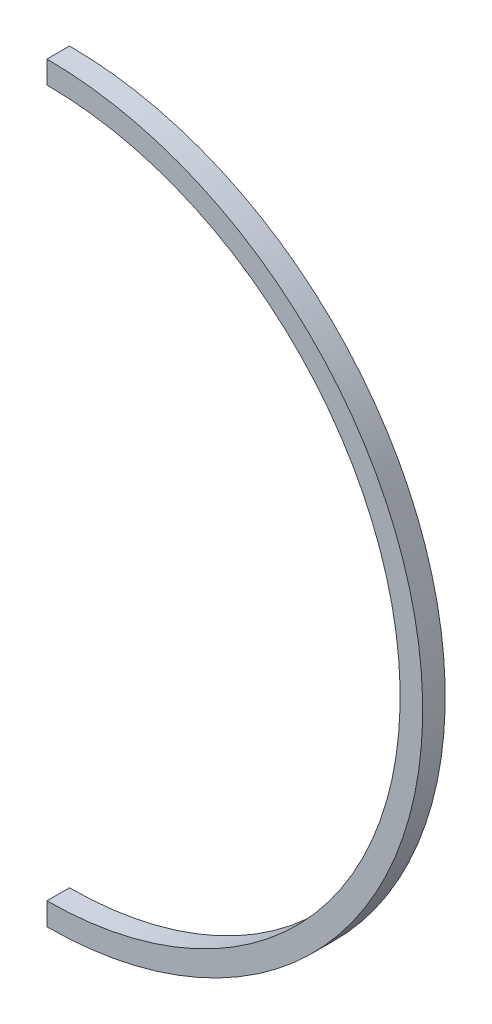
ISO-10303-21;
HEADER;
FILE_DESCRIPTION(('STEP AP214'),'2;1');
FILE_NAME('part.step','',(''),(''),'','','');
FILE_SCHEMA(('AUTOMOTIVE_DESIGN { 1 0 10303 214 1 1 1 1 }'));
ENDSEC;
DATA;
#1=APPLICATION_CONTEXT('core data for automotive mechanical design processes');
#2=APPLICATION_PROTOCOL_DEFINITION('international standard','automotive_design',2000,#1);
#3=PRODUCT_CONTEXT('',#1,'mechanical');
#4=PRODUCT('Part','Part','',(#3));
#5=PRODUCT_RELATED_PRODUCT_CATEGORY('part','',(#4));
#6=PRODUCT_DEFINITION_FORMATION('','',#4);
#7=PRODUCT_DEFINITION_CONTEXT('part definition',#1,'design');
#8=PRODUCT_DEFINITION('design','',#6,#7);
#9=PRODUCT_DEFINITION_SHAPE('','',#8);
#10=(LENGTH_UNIT() NAMED_UNIT(*) SI_UNIT(.MILLI.,.METRE.));
#11=(NAMED_UNIT(*) PLANE_ANGLE_UNIT() SI_UNIT($,.RADIAN.));
#12=(NAMED_UNIT(*) SI_UNIT($,.STERADIAN.) SOLID_ANGLE_UNIT());
#13=UNCERTAINTY_MEASURE_WITH_UNIT(LENGTH_MEASURE(1.E-05),#10,'distance_accuracy_value','');
#14=(GEOMETRIC_REPRESENTATION_CONTEXT(3) GLOBAL_UNCERTAINTY_ASSIGNED_CONTEXT((#13)) GLOBAL_UNIT_ASSIGNED_CONTEXT((#10,
#11,#12)) REPRESENTATION_CONTEXT('',''));
#15=CARTESIAN_POINT('',(0.,0.,0.));
#16=DIRECTION('',(0.,0.,1.));
#17=DIRECTION('',(1.,0.,0.));
#18=AXIS2_PLACEMENT_3D('',#15,#16,#17);
#19=CARTESIAN_POINT('',(0.,0.,3.));
#20=DIRECTION('',(0.,0.,1.));
#21=DIRECTION('',(1.,0.,0.));
#22=AXIS2_PLACEMENT_3D('',#19,#20,#21);
#23=PLANE('',#22);
#24=DIRECTION('',(0.,1.,0.));
#25=VECTOR('',#24,1.);
#26=CARTESIAN_POINT('',(300.,1.71683972880179E-13,3.));
#27=LINE('',#26,#25);
#28=CARTESIAN_POINT('',(300.,47.,3.));
#29=VERTEX_POINT('',#28);
#30=CARTESIAN_POINT('',(300.,50.,3.));
#31=VERTEX_POINT('',#30);
#32=EDGE_CURVE('E79',#29,#31,#27,.T.);
#33=ORIENTED_EDGE('',*,*,#32,.F.);
#34=CARTESIAN_POINT('',(300.,0.,3.));
#35=DIRECTION('',(0.,0.,1.));
#36=DIRECTION('',(1.,0.,0.));
#37=AXIS2_PLACEMENT_3D('',#34,#35,#36);
#38=CIRCLE('',#37,47.);
#39=CARTESIAN_POINT('',(300.,-47.,3.));
#40=VERTEX_POINT('',#39);
#41=EDGE_CURVE('E86',#29,#40,#38,.F.);
#42=ORIENTED_EDGE('',*,*,#41,.T.);
#43=DIRECTION('',(0.,1.,0.));
#44=VECTOR('',#43,1.);
#45=CARTESIAN_POINT('',(300.,1.71683972880179E-13,3.));
#46=LINE('',#45,#44);
#47=CARTESIAN_POINT('',(300.,-50.,3.));
#48=VERTEX_POINT('',#47);
#49=EDGE_CURVE('E85',#48,#40,#46,.T.);
#50=ORIENTED_EDGE('',*,*,#49,.F.);
#51=CARTESIAN_POINT('',(300.,0.,3.));
#52=DIRECTION('',(0.,0.,1.));
#53=DIRECTION('',(1.,0.,0.));
#54=AXIS2_PLACEMENT_3D('',#51,#52,#53);
#55=CIRCLE('',#54,50.);
#56=EDGE_CURVE('E74',#48,#31,#55,.T.);
#57=ORIENTED_EDGE('',*,*,#56,.T.);
#58=EDGE_LOOP('',(#33,#42,#50,#57));
#59=FACE_BOUND('',#58,.T.);
#60=ADVANCED_FACE('F32',(#59),#23,.T.);
#61=CARTESIAN_POINT('',(300.,0.,3.));
#62=DIRECTION('',(0.,0.,1.));
#63=DIRECTION('',(1.,0.,0.));
#64=AXIS2_PLACEMENT_3D('',#61,#62,#63);
#65=CYLINDRICAL_SURFACE('',#64,47.);
#66=ORIENTED_EDGE('',*,*,#41,.F.);
#67=DIRECTION('',(0.,0.,1.));
#68=VECTOR('',#67,1.);
#69=CARTESIAN_POINT('',(300.,47.,3.));
#70=LINE('',#69,#68);
#71=CARTESIAN_POINT('',(300.,47.,0.));
#72=VERTEX_POINT('',#71);
#73=EDGE_CURVE('E11',#72,#29,#70,.T.);
#74=ORIENTED_EDGE('',*,*,#73,.F.);
#75=CARTESIAN_POINT('',(300.,0.,0.));
#76=DIRECTION('',(0.,0.,-1.));
#77=DIRECTION('',(-1.,0.,0.));
#78=AXIS2_PLACEMENT_3D('',#75,#76,#77);
#79=CIRCLE('',#78,47.);
#80=CARTESIAN_POINT('',(300.,-47.,0.));
#81=VERTEX_POINT('',#80);
#82=EDGE_CURVE('E54',#72,#81,#79,.T.);
#83=ORIENTED_EDGE('',*,*,#82,.T.);
#84=DIRECTION('',(0.,0.,1.));
#85=VECTOR('',#84,1.);
#86=CARTESIAN_POINT('',(300.,-47.,3.));
#87=LINE('',#86,#85);
#88=EDGE_CURVE('E93',#81,#40,#87,.T.);
#89=ORIENTED_EDGE('',*,*,#88,.T.);
#90=EDGE_LOOP('',(#66,#74,#83,#89));
#91=FACE_BOUND('',#90,.T.);
#92=ADVANCED_FACE('F34',(#91),#65,.F.);
#93=CARTESIAN_POINT('',(300.,0.,60.));
#94=DIRECTION('',(0.,0.,-1.));
#95=DIRECTION('',(-1.,0.,0.));
#96=AXIS2_PLACEMENT_3D('',#93,#94,#95);
#97=CYLINDRICAL_SURFACE('',#96,50.);
#98=ORIENTED_EDGE('',*,*,#56,.F.);
#99=DIRECTION('',(0.,0.,-1.));
#100=VECTOR('',#99,1.);
#101=CARTESIAN_POINT('',(300.,-50.,60.));
#102=LINE('',#101,#100);
#103=CARTESIAN_POINT('',(300.,-50.,0.));
#104=VERTEX_POINT('',#103);
#105=EDGE_CURVE('E95',#48,#104,#102,.T.);
#106=ORIENTED_EDGE('',*,*,#105,.T.);
#107=CARTESIAN_POINT('',(300.,0.,0.));
#108=DIRECTION('',(0.,0.,1.));
#109=DIRECTION('',(1.,0.,0.));
#110=AXIS2_PLACEMENT_3D('',#107,#108,#109);
#111=CIRCLE('',#110,50.);
#112=CARTESIAN_POINT('',(300.,50.,0.));
#113=VERTEX_POINT('',#112);
#114=EDGE_CURVE('E76',#104,#113,#111,.T.);
#115=ORIENTED_EDGE('',*,*,#114,.T.);
#116=DIRECTION('',(0.,0.,-1.));
#117=VECTOR('',#116,1.);
#118=CARTESIAN_POINT('',(300.,50.,60.));
#119=LINE('',#118,#117);
#120=EDGE_CURVE('E40',#31,#113,#119,.T.);
#121=ORIENTED_EDGE('',*,*,#120,.F.);
#122=EDGE_LOOP('',(#98,#106,#115,#121));
#123=FACE_BOUND('',#122,.T.);
#124=ADVANCED_FACE('F72',(#123),#97,.T.);
#125=CARTESIAN_POINT('',(-300.,0.,0.));
#126=DIRECTION('',(0.,0.,1.));
#127=DIRECTION('',(1.,0.,0.));
#128=AXIS2_PLACEMENT_3D('',#125,#126,#127);
#129=PLANE('',#128);
#130=DIRECTION('',(0.,-1.,0.));
#131=VECTOR('',#130,1.);
#132=CARTESIAN_POINT('',(300.,3.43367945760358E-13,0.));
#133=LINE('',#132,#131);
#134=EDGE_CURVE('E97',#113,#72,#133,.T.);
#135=ORIENTED_EDGE('',*,*,#134,.F.);
#136=ORIENTED_EDGE('',*,*,#114,.F.);
#137=EDGE_CURVE('E77',#81,#104,#133,.T.);
#138=ORIENTED_EDGE('',*,*,#137,.F.);
#139=ORIENTED_EDGE('',*,*,#82,.F.);
#140=EDGE_LOOP('',(#135,#136,#138,#139));
#141=FACE_BOUND('',#140,.T.);
#142=ADVANCED_FACE('F110',(#141),#129,.F.);
#143=CARTESIAN_POINT('',(300.,1.71683972880179E-13,0.));
#144=DIRECTION('',(-1.,0.,0.));
#145=DIRECTION('',(0.,-1.,0.));
#146=AXIS2_PLACEMENT_3D('',#143,#144,#145);
#147=PLANE('',#146);
#148=ORIENTED_EDGE('',*,*,#105,.F.);
#149=ORIENTED_EDGE('',*,*,#49,.T.);
#150=ORIENTED_EDGE('',*,*,#88,.F.);
#151=ORIENTED_EDGE('',*,*,#137,.T.);
#152=EDGE_LOOP('',(#148,#149,#150,#151));
#153=FACE_BOUND('',#152,.T.);
#154=ADVANCED_FACE('F103',(#153),#147,.T.);
#155=ORIENTED_EDGE('',*,*,#73,.T.);
#156=ORIENTED_EDGE('',*,*,#32,.T.);
#157=ORIENTED_EDGE('',*,*,#120,.T.);
#158=ORIENTED_EDGE('',*,*,#134,.T.);
#159=EDGE_LOOP('',(#155,#156,#157,#158));
#160=FACE_BOUND('',#159,.T.);
#161=ADVANCED_FACE('F80',(#160),#147,.T.);
#162=CLOSED_SHELL('',(#60,#92,#124,#142,#154,#161));
#163=MANIFOLD_SOLID_BREP('B2',#162);
#164=ADVANCED_BREP_SHAPE_REPRESENTATION('',(#18,#163),#14);
#165=SHAPE_DEFINITION_REPRESENTATION(#9,#164);
ENDSEC;
END-ISO-10303-21;
